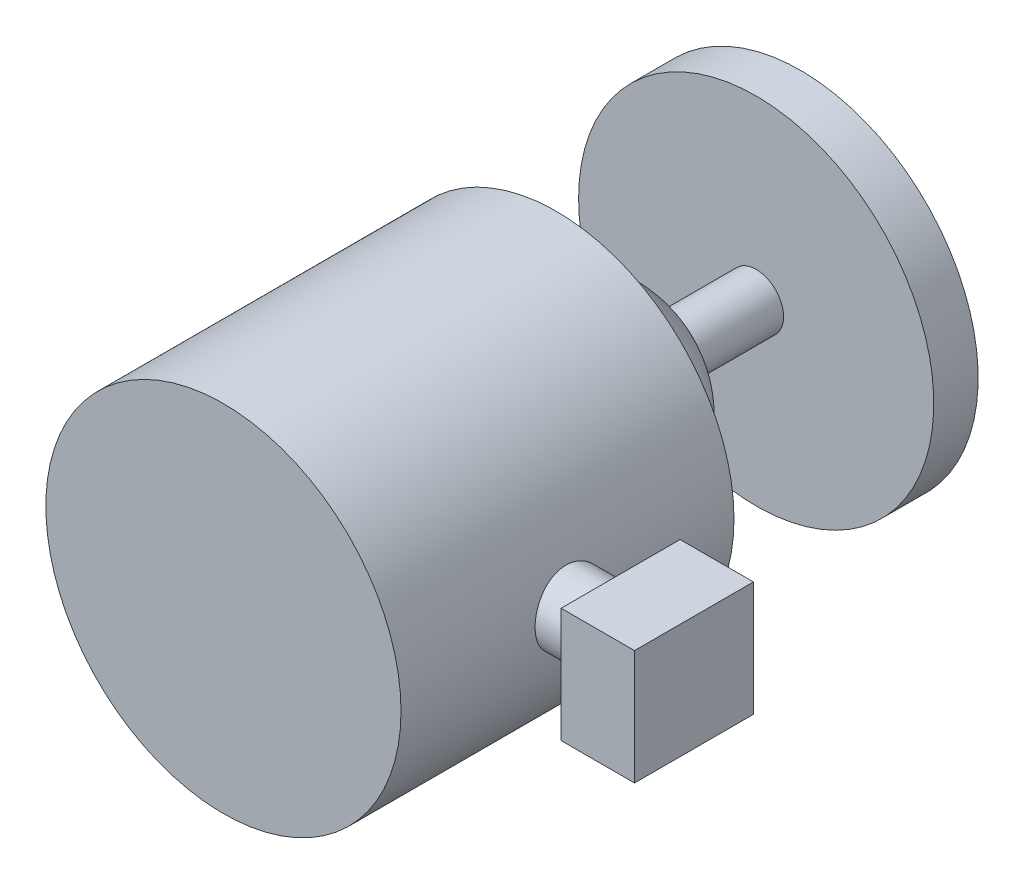
ISO-10303-21;
HEADER;
FILE_DESCRIPTION(('STEP AP214'),'2;1');
FILE_NAME('part.step','',(''),(''),'','','');
FILE_SCHEMA(('AUTOMOTIVE_DESIGN { 1 0 10303 214 1 1 1 1 }'));
ENDSEC;
DATA;
#1=APPLICATION_CONTEXT('core data for automotive mechanical design processes');
#2=APPLICATION_PROTOCOL_DEFINITION('international standard','automotive_design',2000,#1);
#3=PRODUCT_CONTEXT('',#1,'mechanical');
#4=PRODUCT('Part','Part','',(#3));
#5=PRODUCT_RELATED_PRODUCT_CATEGORY('part','',(#4));
#6=PRODUCT_DEFINITION_FORMATION('','',#4);
#7=PRODUCT_DEFINITION_CONTEXT('part definition',#1,'design');
#8=PRODUCT_DEFINITION('design','',#6,#7);
#9=PRODUCT_DEFINITION_SHAPE('','',#8);
#10=(LENGTH_UNIT() NAMED_UNIT(*) SI_UNIT(.MILLI.,.METRE.));
#11=(NAMED_UNIT(*) PLANE_ANGLE_UNIT() SI_UNIT($,.RADIAN.));
#12=(NAMED_UNIT(*) SI_UNIT($,.STERADIAN.) SOLID_ANGLE_UNIT());
#13=UNCERTAINTY_MEASURE_WITH_UNIT(LENGTH_MEASURE(1.E-05),#10,'distance_accuracy_value','');
#14=(GEOMETRIC_REPRESENTATION_CONTEXT(3) GLOBAL_UNCERTAINTY_ASSIGNED_CONTEXT((#13)) GLOBAL_UNIT_ASSIGNED_CONTEXT((#10,
#11,#12)) REPRESENTATION_CONTEXT('',''));
#15=CARTESIAN_POINT('',(0.,0.,0.));
#16=DIRECTION('',(0.,0.,1.));
#17=DIRECTION('',(1.,0.,0.));
#18=AXIS2_PLACEMENT_3D('',#15,#16,#17);
#19=CARTESIAN_POINT('',(0.,0.,-18.));
#20=DIRECTION('',(0.,0.,-1.));
#21=DIRECTION('',(-1.,0.,0.));
#22=AXIS2_PLACEMENT_3D('',#19,#20,#21);
#23=CYLINDRICAL_SURFACE('',#22,16.);
#24=CARTESIAN_POINT('',(0.,0.,-18.));
#25=DIRECTION('',(0.,0.,-1.));
#26=DIRECTION('',(-1.,0.,0.));
#27=AXIS2_PLACEMENT_3D('',#24,#25,#26);
#28=CIRCLE('',#27,16.);
#29=CARTESIAN_POINT('',(-16.,0.,-18.));
#30=VERTEX_POINT('',#29);
#31=EDGE_CURVE('E164',#30,#30,#28,.T.);
#32=ORIENTED_EDGE('',*,*,#31,.T.);
#33=EDGE_LOOP('',(#32));
#34=FACE_BOUND('',#33,.T.);
#35=CARTESIAN_POINT('',(0.,0.,-22.));
#36=DIRECTION('',(0.,0.,-1.));
#37=DIRECTION('',(-1.,0.,0.));
#38=AXIS2_PLACEMENT_3D('',#35,#36,#37);
#39=CIRCLE('',#38,16.);
#40=CARTESIAN_POINT('',(-16.,0.,-22.));
#41=VERTEX_POINT('',#40);
#42=EDGE_CURVE('E159',#41,#41,#39,.T.);
#43=ORIENTED_EDGE('',*,*,#42,.F.);
#44=EDGE_LOOP('',(#43));
#45=FACE_BOUND('',#44,.T.);
#46=ADVANCED_FACE('F45',(#34,#45),#23,.T.);
#47=CARTESIAN_POINT('',(0.,0.,-28.));
#48=DIRECTION('',(0.,0.,1.));
#49=DIRECTION('',(1.,0.,0.));
#50=AXIS2_PLACEMENT_3D('',#47,#48,#49);
#51=CYLINDRICAL_SURFACE('',#50,2.4695732470707);
#52=CARTESIAN_POINT('',(-1.74780160134704,-1.74470100159849,-9.787857694043));
#53=CARTESIAN_POINT('',(-1.84580117992121,-1.64651855471258,-9.78689449018862));
#54=CARTESIAN_POINT('',(-1.93558010237571,-1.53998856824869,-9.78586021363242));
#55=CARTESIAN_POINT('',(-2.09604979825687,-1.31327772022144,-9.78369143059617));
#56=CARTESIAN_POINT('',(-2.16671744191979,-1.19308056529852,-9.78255680485007));
#57=CARTESIAN_POINT('',(-2.28683745719998,-0.942573166914285,-9.78023210229128));
#58=CARTESIAN_POINT('',(-2.3362999636129,-0.812267789829233,-9.7790420522703));
#59=CARTESIAN_POINT('',(-2.41263108057947,-0.54523802147022,-9.77664904691531));
#60=CARTESIAN_POINT('',(-2.43950530413783,-0.408515233791972,-9.77544609486264));
#61=CARTESIAN_POINT('',(-2.46992351582454,-0.132480840441893,-9.77306617934678));
#62=CARTESIAN_POINT('',(-2.47346469666656,0.00683107471566066,-9.77188921902773));
#63=CARTESIAN_POINT('',(-2.45710729134489,0.284077779878121,-9.76959568163903));
#64=CARTESIAN_POINT('',(-2.43720778473117,0.422012515590563,-9.76847910694235));
#65=CARTESIAN_POINT('',(-2.37453322016181,0.692580052318975,-9.76633451290794));
#66=CARTESIAN_POINT('',(-2.33175876524104,0.82521299300308,-9.76530649123658));
#67=CARTESIAN_POINT('',(-2.22454866960387,1.0814150907527,-9.76336056811052));
#68=CARTESIAN_POINT('',(-2.16011307514262,1.20498426717228,-9.76244266642066));
#69=CARTESIAN_POINT('',(-2.01141142381065,1.43954810079623,-9.7607325070056));
#70=CARTESIAN_POINT('',(-1.92714584054971,1.55054305822334,-9.75994024628041));
#71=CARTESIAN_POINT('',(-1.74117545150893,1.75681041378694,-9.75849166033085));
#72=CARTESIAN_POINT('',(-1.63947067967062,1.85208284252314,-9.75783533484191));
#73=CARTESIAN_POINT('',(-1.42151188047732,2.02419808861089,-9.75666492923852));
#74=CARTESIAN_POINT('',(-1.30525824713204,2.10104140489212,-9.75615084527311));
#75=CARTESIAN_POINT('',(-1.06149952251125,2.23412015500647,-9.75526835660703));
#76=CARTESIAN_POINT('',(-0.933994420622619,2.2903555694006,-9.75489995204376));
#77=CARTESIAN_POINT('',(-0.671355141627736,2.38062086744636,-9.75431049976659));
#78=CARTESIAN_POINT('',(-0.536221118689526,2.41465119965204,-9.75408944907606));
#79=CARTESIAN_POINT('',(-0.262157812619002,2.45954198205833,-9.75379536516182));
#80=CARTESIAN_POINT('',(-0.123228531279056,2.47040244320107,-9.75372233186821));
#81=CARTESIAN_POINT('',(0.154480092413385,2.4686451806347,-9.75372445232006));
#82=CARTESIAN_POINT('',(0.293259436229587,2.45602768823021,-9.75379960460561));
#83=CARTESIAN_POINT('',(0.566730031441734,2.40767318724349,-9.75409791824565));
#84=CARTESIAN_POINT('',(0.701421282394912,2.37193617615727,-9.75432107961617));
#85=CARTESIAN_POINT('',(0.962892164962122,2.27835723819153,-9.75491472883571));
#86=CARTESIAN_POINT('',(1.08967179949715,2.22051531947326,-9.75528521663033));
#87=CARTESIAN_POINT('',(1.33172070313568,2.08436870205191,-9.75617182865717));
#88=CARTESIAN_POINT('',(1.44698997248577,2.0060640037872,-9.75668795288627));
#89=CARTESIAN_POINT('',(1.66274720889457,1.83121403583041,-9.75786235308866));
#90=CARTESIAN_POINT('',(1.76323503821469,1.73466859618394,-9.75852063038644));
#91=CARTESIAN_POINT('',(1.94657583433616,1.52607846246577,-9.75997299030783));
#92=CARTESIAN_POINT('',(2.02942879893564,1.41403376645884,-9.76076707294839));
#93=CARTESIAN_POINT('',(2.17514969771769,1.17762357124551,-9.76248067941975));
#94=CARTESIAN_POINT('',(2.23801724649364,1.05325783449595,-9.76340020566916));
#95=CARTESIAN_POINT('',(2.34198090347775,0.795737848800229,-9.76534910361128));
#96=CARTESIAN_POINT('',(2.38307701139538,0.662583599736775,-9.76637847530547));
#97=CARTESIAN_POINT('',(2.44233241878296,0.391262651738832,-9.76852541169484));
#98=CARTESIAN_POINT('',(2.46049109821688,0.253095817409853,-9.76964297877323));
#99=CARTESIAN_POINT('',(2.47335445750105,-0.024324921289597,-9.77193810044339));
#100=CARTESIAN_POINT('',(2.46805912375245,-0.163578826290317,-9.77311565506994));
#101=CARTESIAN_POINT('',(2.43416446558828,-0.439224599972449,-9.77549642302736));
#102=CARTESIAN_POINT('',(2.40556451827628,-0.57561639205404,-9.77669963704323));
#103=CARTESIAN_POINT('',(2.32587174587674,-0.841662327481038,-9.77909225646106));
#104=CARTESIAN_POINT('',(2.27477894219625,-0.971316477238707,-9.78028166187618));
#105=CARTESIAN_POINT('',(2.15155007858835,-1.22020798996462,-9.78260402274951));
#106=CARTESIAN_POINT('',(2.0794138277126,-1.33944525839726,-9.78373697769539));
#107=CARTESIAN_POINT('',(1.91614555543704,-1.56411691698561,-9.78590293730253));
#108=CARTESIAN_POINT('',(1.82501350120762,-1.66955128328584,-9.78693594179104));
#109=CARTESIAN_POINT('',(1.62634270934746,-1.86362128516617,-9.78886029934451));
#110=CARTESIAN_POINT('',(1.51880434543109,-1.95225730328765,-9.78975165563508));
#111=CARTESIAN_POINT('',(1.29037169191205,-2.11021707593079,-9.79135549091508));
#112=CARTESIAN_POINT('',(1.16947737875282,-2.1795407963896,-9.79206796958899));
#113=CARTESIAN_POINT('',(0.917768460866424,-2.29690566208506,-9.79328353111275));
#114=CARTESIAN_POINT('',(0.786954126096342,-2.34494738623302,-9.79378661965837));
#115=CARTESIAN_POINT('',(0.519120981975125,-2.41838505048835,-9.79456154018749));
#116=CARTESIAN_POINT('',(0.382102418174256,-2.44378188601079,-9.79483338131485));
#117=CARTESIAN_POINT('',(0.105767519784411,-2.47121058746644,-9.79513390978432));
#118=CARTESIAN_POINT('',(-0.0335484690468153,-2.47324593769153,-9.79516263338647));
#119=CARTESIAN_POINT('',(-0.310582576530728,-2.45389744500741,-9.79497570402996));
#120=CARTESIAN_POINT('',(-0.448300289636559,-2.4325077840866,-9.79475999036057));
#121=CARTESIAN_POINT('',(-0.718240750325165,-2.36690364909236,-9.79409351888878));
#122=CARTESIAN_POINT('',(-0.850460922051565,-2.3226786029348,-9.79364265221676));
#123=CARTESIAN_POINT('',(-1.1054798143057,-2.21267849484079,-9.79252572040226));
#124=CARTESIAN_POINT('',(-1.22828967581161,-2.14692941758577,-9.79185991475619));
#125=CARTESIAN_POINT('',(-1.41733853442203,-2.0242220110311,-9.79062766288676));
#126=CARTESIAN_POINT('',(-1.48751661319962,-1.97321865063943,-9.7901176404407));
#127=CARTESIAN_POINT('',(-1.6221333553943,-1.86413006473855,-9.78903355817965));
#128=CARTESIAN_POINT('',(-1.68657201880776,-1.80604483922488,-9.78845949836463));
#129=CARTESIAN_POINT('',(-1.74780160134704,-1.74470100159849,-9.787857694043));
#130=B_SPLINE_CURVE_WITH_KNOTS('',3,(#52,#53,#54,#55,#56,#57,#58,#59,#60,#61,#62,#63,#64,#65,
#66,#67,#68,#69,#70,#71,#72,#73,#74,#75,#76,#77,#78,#79,#80,#81,#82,#83,#84,#85,#86,#87,#88,#89,
#90,#91,#92,#93,#94,#95,#96,#97,#98,#99,#100,#101,#102,#103,#104,#105,#106,#107,#108,#109,#110,
#111,#112,#113,#114,#115,#116,#117,#118,#119,#120,#121,#122,#123,#124,#125,#126,#127,#128,#129),
.UNSPECIFIED.,.T.,.F.,(4,2,2,2,2,2,2,2,2,2,2,2,2,2,2,2,2,2,2,2,2,2,2,2,2,2,2,2,2,2,2,2,2,2,2,2,
2,2,4),(0.,0.41585875838349,0.832218587427448,1.24837919876343,1.66443636697079,
2.08054359167076,2.49666715627881,2.91277975147828,3.32889145811729,3.74499322755555,
4.16109418715294,4.57718388041485,4.99327396616398,5.40935564641949,5.82543713017752,
6.24151451472578,6.65759194433785,7.07366922033184,7.48974648741218,7.905827631399,
8.32190882733731,8.73799804666228,9.1540872715399,9.57018774374599,9.98628845721115,
10.4024002927722,10.8185117323094,11.2346269477616,11.6507428823738,12.0668493398221,
12.4829565311903,12.899052402946,13.3151318208767,13.7311491810675,14.1472698898902,
14.5635834228258,14.9793962072916,15.2392224078277,15.4990486085277),.UNSPECIFIED.);
#131=CARTESIAN_POINT('',(-1.74780160134704,-1.74470100159849,-9.787857694043));
#132=VERTEX_POINT('',#131);
#133=EDGE_CURVE('E54',#132,#132,#130,.T.);
#134=ORIENTED_EDGE('',*,*,#133,.T.);
#135=EDGE_LOOP('',(#134));
#136=FACE_BOUND('',#135,.T.);
#137=CARTESIAN_POINT('',(0.,0.,-18.));
#138=DIRECTION('',(0.,0.,-1.));
#139=DIRECTION('',(-1.,0.,0.));
#140=AXIS2_PLACEMENT_3D('',#137,#138,#139);
#141=CIRCLE('',#140,2.4695732470707);
#142=CARTESIAN_POINT('',(-2.4695732470707,0.,-18.));
#143=VERTEX_POINT('',#142);
#144=EDGE_CURVE('E12',#143,#143,#141,.T.);
#145=ORIENTED_EDGE('',*,*,#144,.F.);
#146=EDGE_LOOP('',(#145));
#147=FACE_BOUND('',#146,.T.);
#148=ADVANCED_FACE('F125',(#136,#147),#51,.T.);
#149=CARTESIAN_POINT('',(0.,0.,0.));
#150=DIRECTION('',(0.,0.,-1.));
#151=DIRECTION('',(0.00512052574639891,0.999986890022105,0.));
#152=AXIS2_PLACEMENT_3D('',#149,#150,#151);
#153=CIRCLE('',#152,10.);
#154=TRIMMED_CURVE('',#153,(PARAMETER_VALUE(-1.5789892596461)),
(PARAMETER_VALUE(1.5789892596461)),.T.,.PARAMETER.);
#155=CARTESIAN_POINT('',(-0.000419516542712883,-0.0819273378627129,0.));
#156=DIRECTION('',(0.999986890022105,-0.00512052574639891,0.));
#157=AXIS1_PLACEMENT('',#155,#156);
#158=SURFACE_OF_REVOLUTION('',#154,#157);
#159=CARTESIAN_POINT('',(0.,0.,0.));
#160=DIRECTION('',(0.,0.,1.));
#161=DIRECTION('',(1.,0.,0.));
#162=AXIS2_PLACEMENT_3D('',#159,#160,#161);
#163=CIRCLE('',#162,10.);
#164=CARTESIAN_POINT('',(-9.99995280229754,-0.030723798943769,0.));
#165=VERTEX_POINT('',#164);
#166=CARTESIAN_POINT('',(9.99911376921212,-0.133130876781657,0.));
#167=VERTEX_POINT('',#166);
#168=EDGE_CURVE('E60',#165,#167,#163,.F.);
#169=ORIENTED_EDGE('',*,*,#168,.T.);
#170=CARTESIAN_POINT('',(-0.000839033085425428,-0.163854675725426,0.));
#171=DIRECTION('',(0.,0.,1.));
#172=DIRECTION('',(1.,0.,0.));
#173=AXIS2_PLACEMENT_3D('',#170,#171,#172);
#174=CIRCLE('',#173,10.);
#175=EDGE_CURVE('E100',#167,#165,#174,.F.);
#176=ORIENTED_EDGE('',*,*,#175,.T.);
#177=EDGE_LOOP('',(#169,#176));
#178=FACE_BOUND('',#177,.T.);
#179=ORIENTED_EDGE('',*,*,#133,.F.);
#180=EDGE_LOOP('',(#179));
#181=FACE_BOUND('',#180,.T.);
#182=ADVANCED_FACE('F105',(#178,#181),#158,.T.);
#183=CARTESIAN_POINT('',(0.,0.,30.));
#184=DIRECTION('',(0.,0.,-1.));
#185=DIRECTION('',(-1.,0.,0.));
#186=AXIS2_PLACEMENT_3D('',#183,#184,#185);
#187=CYLINDRICAL_SURFACE('',#186,16.);
#188=CARTESIAN_POINT('',(0.,0.,30.));
#189=DIRECTION('',(0.,0.,1.));
#190=DIRECTION('',(1.,0.,0.));
#191=AXIS2_PLACEMENT_3D('',#188,#189,#190);
#192=CIRCLE('',#191,16.);
#193=CARTESIAN_POINT('',(16.,0.,30.));
#194=VERTEX_POINT('',#193);
#195=EDGE_CURVE('E110',#194,#194,#192,.T.);
#196=ORIENTED_EDGE('',*,*,#195,.F.);
#197=EDGE_LOOP('',(#196));
#198=FACE_BOUND('',#197,.T.);
#199=CARTESIAN_POINT('',(0.,0.,0.));
#200=DIRECTION('',(0.,0.,1.));
#201=DIRECTION('',(1.,0.,0.));
#202=AXIS2_PLACEMENT_3D('',#199,#200,#201);
#203=CIRCLE('',#202,16.);
#204=CARTESIAN_POINT('',(16.,0.,0.));
#205=VERTEX_POINT('',#204);
#206=EDGE_CURVE('E193',#205,#205,#203,.T.);
#207=ORIENTED_EDGE('',*,*,#206,.T.);
#208=EDGE_LOOP('',(#207));
#209=FACE_BOUND('',#208,.T.);
#210=CARTESIAN_POINT('',(15.9953218252492,0.386884616787663,17.9131417304896));
#211=CARTESIAN_POINT('',(15.9995758622211,0.210877241631793,17.9131354137513));
#212=CARTESIAN_POINT('',(16.0009033537713,0.0347195616343173,17.8984572688384));
#213=CARTESIAN_POINT('',(15.9978886719654,-0.312764514781941,17.8401090802633));
#214=CARTESIAN_POINT('',(15.9935422611277,-0.484087202585972,17.7964173801758));
#215=CARTESIAN_POINT('',(15.9800036565844,-0.816820729269743,17.6813837795835));
#216=CARTESIAN_POINT('',(15.9708153947486,-0.97823949215243,17.6100643268797));
#217=CARTESIAN_POINT('',(15.9489171018718,-1.28686036039908,17.4418603238202));
#218=CARTESIAN_POINT('',(15.9362072787498,-1.43406330439796,17.3449772827992));
#219=CARTESIAN_POINT('',(15.9087914681338,-1.71173664905465,17.1272525815114));
#220=CARTESIAN_POINT('',(15.8940667288228,-1.84202431283652,17.0061802501843));
#221=CARTESIAN_POINT('',(15.8646004682781,-2.08060973683348,16.7440119840051));
#222=CARTESIAN_POINT('',(15.8498589458206,-2.18890577435118,16.602914481966));
#223=CARTESIAN_POINT('',(15.8220725832985,-2.3815159681218,16.3029645852241));
#224=CARTESIAN_POINT('',(15.8090467295663,-2.46557232200757,16.1439446808991));
#225=CARTESIAN_POINT('',(15.7865522208322,-2.60573194870569,15.8137931379576));
#226=CARTESIAN_POINT('',(15.7770833276059,-2.66183709360934,15.6426623113728));
#227=CARTESIAN_POINT('',(15.7629980089337,-2.74401798246012,15.294698083051));
#228=CARTESIAN_POINT('',(15.7583404786031,-2.77034828822777,15.1179265167394));
#229=CARTESIAN_POINT('',(15.7543395297019,-2.79301389575711,14.7624180749546));
#230=CARTESIAN_POINT('',(15.7549956830553,-2.78935161375319,14.5836813589544));
#231=CARTESIAN_POINT('',(15.7614956877568,-2.7523784479993,14.2315627572312));
#232=CARTESIAN_POINT('',(15.767277739431,-2.71942074778314,14.0581424656199));
#233=CARTESIAN_POINT('',(15.7832123013071,-2.62535036443814,13.7193284579711));
#234=CARTESIAN_POINT('',(15.7933649950792,-2.56423649872259,13.5539350793944));
#235=CARTESIAN_POINT('',(15.816835359067,-2.41524474117221,13.234857008257));
#236=CARTESIAN_POINT('',(15.8301695156738,-2.3272267405616,13.0812390053262));
#237=CARTESIAN_POINT('',(15.8583111789073,-2.1270062216395,12.7908117991806));
#238=CARTESIAN_POINT('',(15.8731188200628,-2.01480149399233,12.654004133299));
#239=CARTESIAN_POINT('',(15.902558181682,-1.76757248208513,12.39915095323));
#240=CARTESIAN_POINT('',(15.9171848318611,-1.63226069785981,12.2813835311026));
#241=CARTESIAN_POINT('',(15.9441428934952,-1.34360818188541,12.0701839358729));
#242=CARTESIAN_POINT('',(15.956474330692,-1.19026765236649,11.9767514898405));
#243=CARTESIAN_POINT('',(15.9771291339025,-0.870064826603616,11.8170705703537));
#244=CARTESIAN_POINT('',(15.9854586539815,-0.70322375589776,11.7507803814516));
#245=CARTESIAN_POINT('',(15.9968532226506,-0.360602845992333,11.6472022028588));
#246=CARTESIAN_POINT('',(15.9999188743499,-0.184824033213506,11.6099108908816));
#247=CARTESIAN_POINT('',(16.0000766876781,0.167747434199597,11.5658114481344));
#248=CARTESIAN_POINT('',(15.9972606065931,0.344482248140444,11.5585402626795));
#249=CARTESIAN_POINT('',(15.9858024418141,0.696516330973226,11.5733686446513));
#250=CARTESIAN_POINT('',(15.9771605429204,0.871815645222017,11.5954672804616));
#251=CARTESIAN_POINT('',(15.9547114508224,1.21518015047983,11.6680924096949));
#252=CARTESIAN_POINT('',(15.9409291866288,1.3832759591793,11.7184822868365));
#253=CARTESIAN_POINT('',(15.9093524693791,1.70857760182222,11.846034513283));
#254=CARTESIAN_POINT('',(15.8915576343106,1.86578239703498,11.9231994120506));
#255=CARTESIAN_POINT('',(15.8532439300696,2.16752641218812,12.1035052443671));
#256=CARTESIAN_POINT('',(15.8326869179051,2.31182996504453,12.2070323927881));
#257=CARTESIAN_POINT('',(15.7910155182372,2.58116954911939,12.4366077028136));
#258=CARTESIAN_POINT('',(15.7699010680239,2.70620340165027,12.5626584075219));
#259=CARTESIAN_POINT('',(15.7288730423586,2.93535963400396,12.8359921238996));
#260=CARTESIAN_POINT('',(15.7089820957233,3.03914202582645,12.9835639721268));
#261=CARTESIAN_POINT('',(15.6728295839958,3.22040234436846,13.2944744777059));
#262=CARTESIAN_POINT('',(15.6565677816521,3.29788199077385,13.4578121033867));
#263=CARTESIAN_POINT('',(15.629568738679,3.42355100083949,13.7941065815622));
#264=CARTESIAN_POINT('',(15.6187818951677,3.47200409478844,13.9669607416886));
#265=CARTESIAN_POINT('',(15.6037096424939,3.53913149702073,14.3186250595647));
#266=CARTESIAN_POINT('',(15.599423188838,3.55781058946449,14.4974342557296));
#267=CARTESIAN_POINT('',(15.5978530165924,3.56468600190546,14.8516618635976));
#268=CARTESIAN_POINT('',(15.6004152032808,3.55355308321943,15.0270669257787));
#269=CARTESIAN_POINT('',(15.6119338344664,3.50259796598887,15.3734344330185));
#270=CARTESIAN_POINT('',(15.6208902025725,3.46277611018982,15.544396931127));
#271=CARTESIAN_POINT('',(15.6442037268749,3.35586757918861,15.8766212222462));
#272=CARTESIAN_POINT('',(15.6585454431053,3.28885880596561,16.0379092335595));
#273=CARTESIAN_POINT('',(15.6911563889828,3.12956740835003,16.3470418900108));
#274=CARTESIAN_POINT('',(15.7094260059854,3.03728229104927,16.4948852072338));
#275=CARTESIAN_POINT('',(15.7484881438701,2.82783840443574,16.7762174916703));
#276=CARTESIAN_POINT('',(15.7693248753594,2.71020649901389,16.9093481165467));
#277=CARTESIAN_POINT('',(15.8111551037104,2.45441200333271,17.1541940793587));
#278=CARTESIAN_POINT('',(15.8321486395256,2.31624413870383,17.2659038987346));
#279=CARTESIAN_POINT('',(15.8725773451918,2.02084641322378,17.46635219532));
#280=CARTESIAN_POINT('',(15.8919844684907,1.86336206814041,17.5547215991109));
#281=CARTESIAN_POINT('',(15.9270061148687,1.53543749166386,17.7035784535809));
#282=CARTESIAN_POINT('',(15.9426239766563,1.36500884062191,17.7640904918176));
#283=CARTESIAN_POINT('',(15.9654095021718,1.05971058826993,17.8439847360673));
#284=CARTESIAN_POINT('',(15.9737134055409,0.926588154822124,17.8698641347467));
#285=CARTESIAN_POINT('',(15.9870309641187,0.657968356577942,17.9044447302977));
#286=CARTESIAN_POINT('',(15.9920447475348,0.522471084534159,17.9131465965599));
#287=CARTESIAN_POINT('',(15.9953218252492,0.386884616787663,17.9131417304896));
#288=B_SPLINE_CURVE_WITH_KNOTS('',3,(#210,#211,#212,#213,#214,#215,#216,#217,#218,#219,#220,
#221,#222,#223,#224,#225,#226,#227,#228,#229,#230,#231,#232,#233,#234,#235,#236,#237,#238,#239,
#240,#241,#242,#243,#244,#245,#246,#247,#248,#249,#250,#251,#252,#253,#254,#255,#256,#257,#258,
#259,#260,#261,#262,#263,#264,#265,#266,#267,#268,#269,#270,#271,#272,#273,#274,#275,#276,#277,
#278,#279,#280,#281,#282,#283,#284,#285,#286,#287),.UNSPECIFIED.,.T.,.F.,(4,2,2,2,2,2,2,2,2,2,2,
2,2,2,2,2,2,2,2,2,2,2,2,2,2,2,2,2,2,2,2,2,2,2,2,2,2,2,4),(0.,0.527682899299609,1.05576011738518,
1.58340916482764,2.11102706558956,2.64393967327131,3.17689401016933,3.71532354009502,
4.25371700271508,4.78747178780717,5.32118357347563,5.84854694296022,6.37593246424582,
6.90611264668506,7.43634127895089,7.97372492372751,8.51110254119524,9.04765112433064,
9.58413822815958,10.1123184780277,10.6404819743187,11.1661166774723,11.6918014442289,
12.2256817094744,12.7596222925404,13.3015326381121,13.8434075465036,14.3802813055257,
14.9170687896411,15.4418807636509,15.966686467859,16.4899988851,17.0133629332198,
17.547505821618,18.0817861348559,18.6240678352569,19.1658699832338,19.5723839069,
19.9788819888292),.UNSPECIFIED.);
#289=CARTESIAN_POINT('',(15.9953218252492,0.386884616787663,17.9131417304896));
#290=VERTEX_POINT('',#289);
#291=EDGE_CURVE('E107',#290,#290,#288,.T.);
#292=ORIENTED_EDGE('',*,*,#291,.F.);
#293=EDGE_LOOP('',(#292));
#294=FACE_BOUND('',#293,.T.);
#295=ADVANCED_FACE('F47',(#198,#209,#294),#187,.T.);
#296=CARTESIAN_POINT('',(0.,0.,30.));
#297=DIRECTION('',(0.,0.,1.));
#298=DIRECTION('',(1.,0.,0.));
#299=AXIS2_PLACEMENT_3D('',#296,#297,#298);
#300=PLANE('',#299);
#301=ORIENTED_EDGE('',*,*,#195,.T.);
#302=EDGE_LOOP('',(#301));
#303=FACE_BOUND('',#302,.T.);
#304=ADVANCED_FACE('F201',(#303),#300,.T.);
#305=CARTESIAN_POINT('',(0.,0.,0.));
#306=DIRECTION('',(0.,0.,1.));
#307=DIRECTION('',(1.,0.,0.));
#308=AXIS2_PLACEMENT_3D('',#305,#306,#307);
#309=PLANE('',#308);
#310=ORIENTED_EDGE('',*,*,#175,.F.);
#311=ORIENTED_EDGE('',*,*,#168,.F.);
#312=EDGE_LOOP('',(#310,#311));
#313=FACE_BOUND('',#312,.T.);
#314=ORIENTED_EDGE('',*,*,#206,.F.);
#315=EDGE_LOOP('',(#314));
#316=FACE_BOUND('',#315,.T.);
#317=ADVANCED_FACE('F101',(#313,#316),#309,.F.);
#318=CARTESIAN_POINT('',(20.5820308420408,0.386884616787663,14.7381417304896));
#319=DIRECTION('',(-1.,0.,0.));
#320=DIRECTION('',(0.,0.,1.));
#321=AXIS2_PLACEMENT_3D('',#318,#319,#320);
#322=CYLINDRICAL_SURFACE('',#321,3.175);
#323=CARTESIAN_POINT('',(20.5820308420408,0.386884616787663,14.7381417304896));
#324=DIRECTION('',(1.,0.,0.));
#325=DIRECTION('',(0.,0.,-1.));
#326=AXIS2_PLACEMENT_3D('',#323,#324,#325);
#327=CIRCLE('',#326,3.175);
#328=CARTESIAN_POINT('',(20.5820308420408,0.386884616787663,11.5631417304896));
#329=VERTEX_POINT('',#328);
#330=EDGE_CURVE('E190',#329,#329,#327,.T.);
#331=ORIENTED_EDGE('',*,*,#330,.F.);
#332=EDGE_LOOP('',(#331));
#333=FACE_BOUND('',#332,.T.);
#334=ORIENTED_EDGE('',*,*,#291,.T.);
#335=EDGE_LOOP('',(#334));
#336=FACE_BOUND('',#335,.T.);
#337=ADVANCED_FACE('F200',(#333,#336),#322,.T.);
#338=CARTESIAN_POINT('',(27.1940616840816,-4.93214441061318,9.44070791648536));
#339=DIRECTION('',(0.,0.,1.));
#340=DIRECTION('',(1.,0.,0.));
#341=AXIS2_PLACEMENT_3D('',#338,#339,#340);
#342=PLANE('',#341);
#343=DIRECTION('',(0.,1.,0.));
#344=VECTOR('',#343,1.);
#345=CARTESIAN_POINT('',(20.5820308420408,-4.93214441061318,9.44070791648536));
#346=LINE('',#345,#344);
#347=CARTESIAN_POINT('',(20.5820308420408,-4.93214441061318,9.44070791648536));
#348=VERTEX_POINT('',#347);
#349=CARTESIAN_POINT('',(20.5820308420408,5.39984775989574,9.44070791648536));
#350=VERTEX_POINT('',#349);
#351=EDGE_CURVE('E167',#348,#350,#346,.T.);
#352=ORIENTED_EDGE('',*,*,#351,.T.);
#353=DIRECTION('',(-1.,0.,0.));
#354=VECTOR('',#353,1.);
#355=CARTESIAN_POINT('',(27.1940616840816,5.39984775989574,9.44070791648536));
#356=LINE('',#355,#354);
#357=CARTESIAN_POINT('',(27.1940616840816,5.39984775989574,9.44070791648536));
#358=VERTEX_POINT('',#357);
#359=EDGE_CURVE('E188',#358,#350,#356,.T.);
#360=ORIENTED_EDGE('',*,*,#359,.F.);
#361=DIRECTION('',(0.,1.,0.));
#362=VECTOR('',#361,1.);
#363=CARTESIAN_POINT('',(27.1940616840816,-4.93214441061318,9.44070791648536));
#364=LINE('',#363,#362);
#365=CARTESIAN_POINT('',(27.1940616840816,-4.93214441061318,9.44070791648536));
#366=VERTEX_POINT('',#365);
#367=EDGE_CURVE('E168',#366,#358,#364,.T.);
#368=ORIENTED_EDGE('',*,*,#367,.F.);
#369=DIRECTION('',(-1.,0.,0.));
#370=VECTOR('',#369,1.);
#371=CARTESIAN_POINT('',(27.1940616840816,-4.93214441061318,9.44070791648536));
#372=LINE('',#371,#370);
#373=EDGE_CURVE('E174',#366,#348,#372,.T.);
#374=ORIENTED_EDGE('',*,*,#373,.T.);
#375=EDGE_LOOP('',(#352,#360,#368,#374));
#376=FACE_BOUND('',#375,.T.);
#377=ADVANCED_FACE('F206',(#376),#342,.F.);
#378=CARTESIAN_POINT('',(27.1940616840816,5.39984775989574,20.1553664636798));
#379=DIRECTION('',(0.,-1.,0.));
#380=DIRECTION('',(0.,0.,-1.));
#381=AXIS2_PLACEMENT_3D('',#378,#379,#380);
#382=PLANE('',#381);
#383=DIRECTION('',(0.,0.,1.));
#384=VECTOR('',#383,1.);
#385=CARTESIAN_POINT('',(20.5820308420408,5.39984775989574,20.1553664636798));
#386=LINE('',#385,#384);
#387=CARTESIAN_POINT('',(20.5820308420408,5.39984775989574,20.1553664636798));
#388=VERTEX_POINT('',#387);
#389=EDGE_CURVE('E177',#350,#388,#386,.T.);
#390=ORIENTED_EDGE('',*,*,#389,.T.);
#391=DIRECTION('',(-1.,0.,0.));
#392=VECTOR('',#391,1.);
#393=CARTESIAN_POINT('',(27.1940616840816,5.39984775989574,20.1553664636798));
#394=LINE('',#393,#392);
#395=CARTESIAN_POINT('',(27.1940616840816,5.39984775989574,20.1553664636798));
#396=VERTEX_POINT('',#395);
#397=EDGE_CURVE('E185',#396,#388,#394,.T.);
#398=ORIENTED_EDGE('',*,*,#397,.F.);
#399=DIRECTION('',(0.,0.,1.));
#400=VECTOR('',#399,1.);
#401=CARTESIAN_POINT('',(27.1940616840816,5.39984775989574,20.1553664636798));
#402=LINE('',#401,#400);
#403=EDGE_CURVE('E98',#358,#396,#402,.T.);
#404=ORIENTED_EDGE('',*,*,#403,.F.);
#405=ORIENTED_EDGE('',*,*,#359,.T.);
#406=EDGE_LOOP('',(#390,#398,#404,#405));
#407=FACE_BOUND('',#406,.T.);
#408=ADVANCED_FACE('F214',(#407),#382,.F.);
#409=CARTESIAN_POINT('',(27.1940616840816,-4.93214441061318,20.1553664636798));
#410=DIRECTION('',(0.,0.,-1.));
#411=DIRECTION('',(-1.,0.,0.));
#412=AXIS2_PLACEMENT_3D('',#409,#410,#411);
#413=PLANE('',#412);
#414=DIRECTION('',(0.,-1.,0.));
#415=VECTOR('',#414,1.);
#416=CARTESIAN_POINT('',(20.5820308420408,-4.93214441061318,20.1553664636798));
#417=LINE('',#416,#415);
#418=CARTESIAN_POINT('',(20.5820308420408,-4.93214441061318,20.1553664636798));
#419=VERTEX_POINT('',#418);
#420=EDGE_CURVE('E179',#388,#419,#417,.T.);
#421=ORIENTED_EDGE('',*,*,#420,.T.);
#422=DIRECTION('',(-1.,0.,0.));
#423=VECTOR('',#422,1.);
#424=CARTESIAN_POINT('',(27.1940616840816,-4.93214441061318,20.1553664636798));
#425=LINE('',#424,#423);
#426=CARTESIAN_POINT('',(27.1940616840816,-4.93214441061318,20.1553664636798));
#427=VERTEX_POINT('',#426);
#428=EDGE_CURVE('E183',#427,#419,#425,.T.);
#429=ORIENTED_EDGE('',*,*,#428,.F.);
#430=DIRECTION('',(0.,-1.,0.));
#431=VECTOR('',#430,1.);
#432=CARTESIAN_POINT('',(27.1940616840816,-4.93214441061318,20.1553664636798));
#433=LINE('',#432,#431);
#434=EDGE_CURVE('E171',#396,#427,#433,.T.);
#435=ORIENTED_EDGE('',*,*,#434,.F.);
#436=ORIENTED_EDGE('',*,*,#397,.T.);
#437=EDGE_LOOP('',(#421,#429,#435,#436));
#438=FACE_BOUND('',#437,.T.);
#439=ADVANCED_FACE('F218',(#438),#413,.F.);
#440=CARTESIAN_POINT('',(27.1940616840816,-4.93214441061318,20.1553664636798));
#441=DIRECTION('',(0.,1.,0.));
#442=DIRECTION('',(0.,0.,1.));
#443=AXIS2_PLACEMENT_3D('',#440,#441,#442);
#444=PLANE('',#443);
#445=DIRECTION('',(0.,0.,-1.));
#446=VECTOR('',#445,1.);
#447=CARTESIAN_POINT('',(20.5820308420408,-4.93214441061318,20.1553664636798));
#448=LINE('',#447,#446);
#449=EDGE_CURVE('E90',#419,#348,#448,.T.);
#450=ORIENTED_EDGE('',*,*,#449,.T.);
#451=ORIENTED_EDGE('',*,*,#373,.F.);
#452=DIRECTION('',(0.,0.,-1.));
#453=VECTOR('',#452,1.);
#454=CARTESIAN_POINT('',(27.1940616840816,-4.93214441061318,20.1553664636798));
#455=LINE('',#454,#453);
#456=EDGE_CURVE('E69',#427,#366,#455,.T.);
#457=ORIENTED_EDGE('',*,*,#456,.F.);
#458=ORIENTED_EDGE('',*,*,#428,.T.);
#459=EDGE_LOOP('',(#450,#451,#457,#458));
#460=FACE_BOUND('',#459,.T.);
#461=ADVANCED_FACE('F221',(#460),#444,.F.);
#462=CARTESIAN_POINT('',(27.1940616840816,0.,0.));
#463=DIRECTION('',(-1.,0.,0.));
#464=DIRECTION('',(0.,0.,1.));
#465=AXIS2_PLACEMENT_3D('',#462,#463,#464);
#466=PLANE('',#465);
#467=ORIENTED_EDGE('',*,*,#367,.T.);
#468=ORIENTED_EDGE('',*,*,#403,.T.);
#469=ORIENTED_EDGE('',*,*,#434,.T.);
#470=ORIENTED_EDGE('',*,*,#456,.T.);
#471=EDGE_LOOP('',(#467,#468,#469,#470));
#472=FACE_BOUND('',#471,.T.);
#473=ADVANCED_FACE('F225',(#472),#466,.F.);
#474=CARTESIAN_POINT('',(20.5820308420408,0.,0.));
#475=DIRECTION('',(-1.,0.,0.));
#476=DIRECTION('',(0.,0.,1.));
#477=AXIS2_PLACEMENT_3D('',#474,#475,#476);
#478=PLANE('',#477);
#479=ORIENTED_EDGE('',*,*,#330,.T.);
#480=EDGE_LOOP('',(#479));
#481=FACE_BOUND('',#480,.T.);
#482=ORIENTED_EDGE('',*,*,#351,.F.);
#483=ORIENTED_EDGE('',*,*,#449,.F.);
#484=ORIENTED_EDGE('',*,*,#420,.F.);
#485=ORIENTED_EDGE('',*,*,#389,.F.);
#486=EDGE_LOOP('',(#482,#483,#484,#485));
#487=FACE_BOUND('',#486,.T.);
#488=ADVANCED_FACE('F142',(#481,#487),#478,.T.);
#489=CARTESIAN_POINT('',(0.,0.,-18.));
#490=DIRECTION('',(0.,0.,-1.));
#491=DIRECTION('',(-1.,0.,0.));
#492=AXIS2_PLACEMENT_3D('',#489,#490,#491);
#493=PLANE('',#492);
#494=ORIENTED_EDGE('',*,*,#144,.T.);
#495=EDGE_LOOP('',(#494));
#496=FACE_BOUND('',#495,.T.);
#497=ORIENTED_EDGE('',*,*,#31,.F.);
#498=EDGE_LOOP('',(#497));
#499=FACE_BOUND('',#498,.T.);
#500=ADVANCED_FACE('F138',(#496,#499),#493,.F.);
#501=CARTESIAN_POINT('',(0.,0.,-22.));
#502=DIRECTION('',(0.,0.,-1.));
#503=DIRECTION('',(-1.,0.,0.));
#504=AXIS2_PLACEMENT_3D('',#501,#502,#503);
#505=PLANE('',#504);
#506=CARTESIAN_POINT('',(0.,0.,-22.));
#507=DIRECTION('',(0.,0.,-1.));
#508=DIRECTION('',(-1.,0.,0.));
#509=AXIS2_PLACEMENT_3D('',#506,#507,#508);
#510=CIRCLE('',#509,2.5);
#511=CARTESIAN_POINT('',(-2.5,0.,-22.));
#512=VERTEX_POINT('',#511);
#513=EDGE_CURVE('E154',#512,#512,#510,.T.);
#514=ORIENTED_EDGE('',*,*,#513,.F.);
#515=EDGE_LOOP('',(#514));
#516=FACE_BOUND('',#515,.T.);
#517=ORIENTED_EDGE('',*,*,#42,.T.);
#518=EDGE_LOOP('',(#517));
#519=FACE_BOUND('',#518,.T.);
#520=ADVANCED_FACE('F141',(#516,#519),#505,.T.);
#521=CARTESIAN_POINT('',(0.,0.,-22.));
#522=DIRECTION('',(0.,0.,-1.));
#523=DIRECTION('',(-1.,0.,0.));
#524=AXIS2_PLACEMENT_3D('',#521,#522,#523);
#525=CYLINDRICAL_SURFACE('',#524,2.5);
#526=ORIENTED_EDGE('',*,*,#513,.T.);
#527=EDGE_LOOP('',(#526));
#528=FACE_BOUND('',#527,.T.);
#529=CARTESIAN_POINT('',(0.,0.,-28.));
#530=DIRECTION('',(0.,0.,-1.));
#531=DIRECTION('',(-1.,0.,0.));
#532=AXIS2_PLACEMENT_3D('',#529,#530,#531);
#533=CIRCLE('',#532,2.5);
#534=CARTESIAN_POINT('',(-2.5,0.,-28.));
#535=VERTEX_POINT('',#534);
#536=EDGE_CURVE('E157',#535,#535,#533,.T.);
#537=ORIENTED_EDGE('',*,*,#536,.F.);
#538=EDGE_LOOP('',(#537));
#539=FACE_BOUND('',#538,.T.);
#540=ADVANCED_FACE('F133',(#528,#539),#525,.T.);
#541=CARTESIAN_POINT('',(0.,0.,-28.));
#542=DIRECTION('',(0.,0.,-1.));
#543=DIRECTION('',(-1.,0.,0.));
#544=AXIS2_PLACEMENT_3D('',#541,#542,#543);
#545=PLANE('',#544);
#546=ORIENTED_EDGE('',*,*,#536,.T.);
#547=EDGE_LOOP('',(#546));
#548=FACE_BOUND('',#547,.T.);
#549=ADVANCED_FACE('F130',(#548),#545,.T.);
#550=CLOSED_SHELL('',(#46,#148,#182,#295,#304,#317,#337,#377,#408,#439,#461,#473,#488,#500,#520,
#540,#549));
#551=MANIFOLD_SOLID_BREP('B2',#550);
#552=ADVANCED_BREP_SHAPE_REPRESENTATION('',(#18,#551),#14);
#553=SHAPE_DEFINITION_REPRESENTATION(#9,#552);
ENDSEC;
END-ISO-10303-21;
